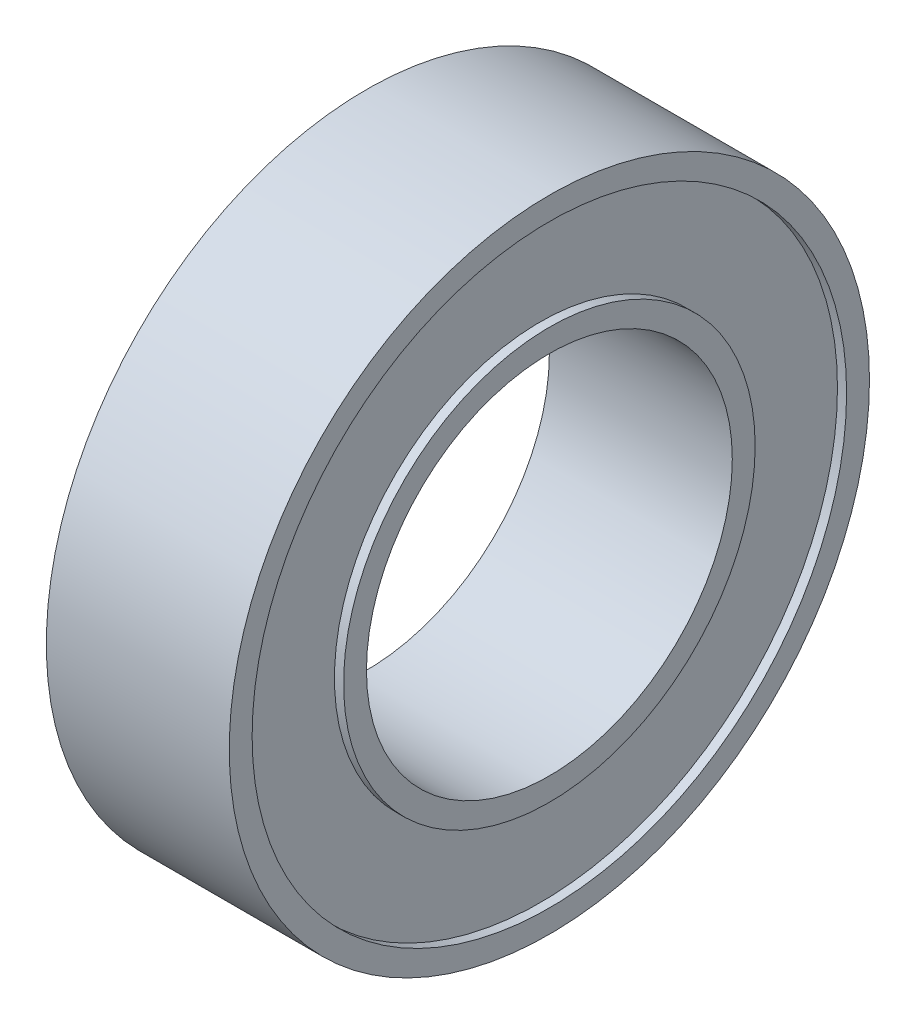
ISO-10303-21;
HEADER;
FILE_DESCRIPTION(('STEP AP214'),'2;1');
FILE_NAME('part.step','',(''),(''),'','','');
FILE_SCHEMA(('AUTOMOTIVE_DESIGN { 1 0 10303 214 1 1 1 1 }'));
ENDSEC;
DATA;
#1=APPLICATION_CONTEXT('core data for automotive mechanical design processes');
#2=APPLICATION_PROTOCOL_DEFINITION('international standard','automotive_design',2000,#1);
#3=PRODUCT_CONTEXT('',#1,'mechanical');
#4=PRODUCT('Part','Part','',(#3));
#5=PRODUCT_RELATED_PRODUCT_CATEGORY('part','',(#4));
#6=PRODUCT_DEFINITION_FORMATION('','',#4);
#7=PRODUCT_DEFINITION_CONTEXT('part definition',#1,'design');
#8=PRODUCT_DEFINITION('design','',#6,#7);
#9=PRODUCT_DEFINITION_SHAPE('','',#8);
#10=(LENGTH_UNIT() NAMED_UNIT(*) SI_UNIT(.MILLI.,.METRE.));
#11=(NAMED_UNIT(*) PLANE_ANGLE_UNIT() SI_UNIT($,.RADIAN.));
#12=(NAMED_UNIT(*) SI_UNIT($,.STERADIAN.) SOLID_ANGLE_UNIT());
#13=UNCERTAINTY_MEASURE_WITH_UNIT(LENGTH_MEASURE(1.E-05),#10,'distance_accuracy_value','');
#14=(GEOMETRIC_REPRESENTATION_CONTEXT(3) GLOBAL_UNCERTAINTY_ASSIGNED_CONTEXT((#13)) GLOBAL_UNIT_ASSIGNED_CONTEXT((#10,
#11,#12)) REPRESENTATION_CONTEXT('',''));
#15=CARTESIAN_POINT('',(0.,0.,0.));
#16=DIRECTION('',(0.,0.,1.));
#17=DIRECTION('',(1.,0.,0.));
#18=AXIS2_PLACEMENT_3D('',#15,#16,#17);
#19=CARTESIAN_POINT('',(0.,0.,0.));
#20=DIRECTION('',(1.,0.,0.));
#21=DIRECTION('',(0.,0.,-1.));
#22=AXIS2_PLACEMENT_3D('',#19,#20,#21);
#23=PLANE('',#22);
#24=CARTESIAN_POINT('',(0.,0.,0.));
#25=DIRECTION('',(1.,0.,0.));
#26=DIRECTION('',(0.,0.,-1.));
#27=AXIS2_PLACEMENT_3D('',#24,#25,#26);
#28=CIRCLE('',#27,4.);
#29=CARTESIAN_POINT('',(0.,0.,-4.));
#30=VERTEX_POINT('',#29);
#31=EDGE_CURVE('E46',#30,#30,#28,.T.);
#32=ORIENTED_EDGE('',*,*,#31,.T.);
#33=EDGE_LOOP('',(#32));
#34=FACE_BOUND('',#33,.T.);
#35=CARTESIAN_POINT('',(0.,0.,0.));
#36=DIRECTION('',(-1.,0.,0.));
#37=DIRECTION('',(0.,0.,1.));
#38=AXIS2_PLACEMENT_3D('',#35,#36,#37);
#39=CIRCLE('',#38,4.5);
#40=CARTESIAN_POINT('',(0.,0.,4.5));
#41=VERTEX_POINT('',#40);
#42=EDGE_CURVE('E70',#41,#41,#39,.T.);
#43=ORIENTED_EDGE('',*,*,#42,.T.);
#44=EDGE_LOOP('',(#43));
#45=FACE_BOUND('',#44,.T.);
#46=ADVANCED_FACE('F33',(#34,#45),#23,.F.);
#47=CARTESIAN_POINT('',(4.,0.,0.));
#48=DIRECTION('',(1.,0.,0.));
#49=DIRECTION('',(0.,0.,-1.));
#50=AXIS2_PLACEMENT_3D('',#47,#48,#49);
#51=PLANE('',#50);
#52=CARTESIAN_POINT('',(4.,0.,0.));
#53=DIRECTION('',(1.,0.,0.));
#54=DIRECTION('',(0.,0.,-1.));
#55=AXIS2_PLACEMENT_3D('',#52,#53,#54);
#56=CIRCLE('',#55,4.);
#57=CARTESIAN_POINT('',(4.,0.,-4.));
#58=VERTEX_POINT('',#57);
#59=EDGE_CURVE('E44',#58,#58,#56,.T.);
#60=ORIENTED_EDGE('',*,*,#59,.F.);
#61=EDGE_LOOP('',(#60));
#62=FACE_BOUND('',#61,.T.);
#63=CARTESIAN_POINT('',(4.,0.,0.));
#64=DIRECTION('',(1.,0.,0.));
#65=DIRECTION('',(0.,0.,-1.));
#66=AXIS2_PLACEMENT_3D('',#63,#64,#65);
#67=CIRCLE('',#66,4.5);
#68=CARTESIAN_POINT('',(4.,0.,-4.5));
#69=VERTEX_POINT('',#68);
#70=EDGE_CURVE('E58',#69,#69,#67,.T.);
#71=ORIENTED_EDGE('',*,*,#70,.T.);
#72=EDGE_LOOP('',(#71));
#73=FACE_BOUND('',#72,.T.);
#74=ADVANCED_FACE('F108',(#62,#73),#51,.T.);
#75=CARTESIAN_POINT('',(4.,0.,0.));
#76=DIRECTION('',(1.,0.,0.));
#77=DIRECTION('',(0.,0.,-1.));
#78=AXIS2_PLACEMENT_3D('',#75,#76,#77);
#79=CIRCLE('',#78,6.5);
#80=CARTESIAN_POINT('',(4.,0.,-6.5));
#81=VERTEX_POINT('',#80);
#82=EDGE_CURVE('E52',#81,#81,#79,.T.);
#83=ORIENTED_EDGE('',*,*,#82,.F.);
#84=EDGE_LOOP('',(#83));
#85=FACE_BOUND('',#84,.T.);
#86=CARTESIAN_POINT('',(4.,0.,0.));
#87=DIRECTION('',(1.,0.,0.));
#88=DIRECTION('',(0.,0.,-1.));
#89=AXIS2_PLACEMENT_3D('',#86,#87,#88);
#90=CIRCLE('',#89,7.);
#91=CARTESIAN_POINT('',(4.,0.,-7.));
#92=VERTEX_POINT('',#91);
#93=EDGE_CURVE('E10',#92,#92,#90,.T.);
#94=ORIENTED_EDGE('',*,*,#93,.T.);
#95=EDGE_LOOP('',(#94));
#96=FACE_BOUND('',#95,.T.);
#97=ADVANCED_FACE('F95',(#85,#96),#51,.T.);
#98=CARTESIAN_POINT('',(0.,0.,0.));
#99=DIRECTION('',(-1.,0.,0.));
#100=DIRECTION('',(0.,0.,1.));
#101=AXIS2_PLACEMENT_3D('',#98,#99,#100);
#102=CIRCLE('',#101,6.5);
#103=CARTESIAN_POINT('',(0.,0.,6.5));
#104=VERTEX_POINT('',#103);
#105=EDGE_CURVE('E64',#104,#104,#102,.T.);
#106=ORIENTED_EDGE('',*,*,#105,.F.);
#107=EDGE_LOOP('',(#106));
#108=FACE_BOUND('',#107,.T.);
#109=CARTESIAN_POINT('',(0.,0.,0.));
#110=DIRECTION('',(1.,0.,0.));
#111=DIRECTION('',(0.,0.,-1.));
#112=AXIS2_PLACEMENT_3D('',#109,#110,#111);
#113=CIRCLE('',#112,7.);
#114=CARTESIAN_POINT('',(0.,0.,-7.));
#115=VERTEX_POINT('',#114);
#116=EDGE_CURVE('E37',#115,#115,#113,.T.);
#117=ORIENTED_EDGE('',*,*,#116,.F.);
#118=EDGE_LOOP('',(#117));
#119=FACE_BOUND('',#118,.T.);
#120=ADVANCED_FACE('F92',(#108,#119),#23,.F.);
#121=CARTESIAN_POINT('',(4.,0.,0.));
#122=DIRECTION('',(-1.,0.,0.));
#123=DIRECTION('',(0.,0.,1.));
#124=AXIS2_PLACEMENT_3D('',#121,#122,#123);
#125=CYLINDRICAL_SURFACE('',#124,7.);
#126=ORIENTED_EDGE('',*,*,#93,.F.);
#127=EDGE_LOOP('',(#126));
#128=FACE_BOUND('',#127,.T.);
#129=ORIENTED_EDGE('',*,*,#116,.T.);
#130=EDGE_LOOP('',(#129));
#131=FACE_BOUND('',#130,.T.);
#132=ADVANCED_FACE('F35',(#128,#131),#125,.T.);
#133=CARTESIAN_POINT('',(4.,0.,0.));
#134=DIRECTION('',(-1.,0.,0.));
#135=DIRECTION('',(0.,0.,1.));
#136=AXIS2_PLACEMENT_3D('',#133,#134,#135);
#137=CYLINDRICAL_SURFACE('',#136,4.);
#138=ORIENTED_EDGE('',*,*,#59,.T.);
#139=EDGE_LOOP('',(#138));
#140=FACE_BOUND('',#139,.T.);
#141=ORIENTED_EDGE('',*,*,#31,.F.);
#142=EDGE_LOOP('',(#141));
#143=FACE_BOUND('',#142,.T.);
#144=ADVANCED_FACE('F99',(#140,#143),#137,.F.);
#145=CARTESIAN_POINT('',(3.8,0.,0.));
#146=DIRECTION('',(1.,0.,0.));
#147=DIRECTION('',(0.,0.,-1.));
#148=AXIS2_PLACEMENT_3D('',#145,#146,#147);
#149=CYLINDRICAL_SURFACE('',#148,6.5);
#150=CARTESIAN_POINT('',(3.8,0.,0.));
#151=DIRECTION('',(1.,0.,0.));
#152=DIRECTION('',(0.,0.,-1.));
#153=AXIS2_PLACEMENT_3D('',#150,#151,#152);
#154=CIRCLE('',#153,6.5);
#155=CARTESIAN_POINT('',(3.8,0.,-6.5));
#156=VERTEX_POINT('',#155);
#157=EDGE_CURVE('E49',#156,#156,#154,.T.);
#158=ORIENTED_EDGE('',*,*,#157,.F.);
#159=EDGE_LOOP('',(#158));
#160=FACE_BOUND('',#159,.T.);
#161=ORIENTED_EDGE('',*,*,#82,.T.);
#162=EDGE_LOOP('',(#161));
#163=FACE_BOUND('',#162,.T.);
#164=ADVANCED_FACE('F104',(#160,#163),#149,.F.);
#165=CARTESIAN_POINT('',(3.8,0.,0.));
#166=DIRECTION('',(1.,0.,0.));
#167=DIRECTION('',(0.,0.,-1.));
#168=AXIS2_PLACEMENT_3D('',#165,#166,#167);
#169=PLANE('',#168);
#170=CARTESIAN_POINT('',(3.8,0.,0.));
#171=DIRECTION('',(1.,0.,0.));
#172=DIRECTION('',(0.,0.,-1.));
#173=AXIS2_PLACEMENT_3D('',#170,#171,#172);
#174=CIRCLE('',#173,4.5);
#175=CARTESIAN_POINT('',(3.8,0.,-4.5));
#176=VERTEX_POINT('',#175);
#177=EDGE_CURVE('E55',#176,#176,#174,.T.);
#178=ORIENTED_EDGE('',*,*,#177,.F.);
#179=EDGE_LOOP('',(#178));
#180=FACE_BOUND('',#179,.T.);
#181=ORIENTED_EDGE('',*,*,#157,.T.);
#182=EDGE_LOOP('',(#181));
#183=FACE_BOUND('',#182,.T.);
#184=ADVANCED_FACE('F121',(#180,#183),#169,.T.);
#185=CARTESIAN_POINT('',(3.8,0.,0.));
#186=DIRECTION('',(1.,0.,0.));
#187=DIRECTION('',(0.,0.,-1.));
#188=AXIS2_PLACEMENT_3D('',#185,#186,#187);
#189=CYLINDRICAL_SURFACE('',#188,4.5);
#190=ORIENTED_EDGE('',*,*,#177,.T.);
#191=EDGE_LOOP('',(#190));
#192=FACE_BOUND('',#191,.T.);
#193=ORIENTED_EDGE('',*,*,#70,.F.);
#194=EDGE_LOOP('',(#193));
#195=FACE_BOUND('',#194,.T.);
#196=ADVANCED_FACE('F88',(#192,#195),#189,.T.);
#197=CARTESIAN_POINT('',(0.2,0.,0.));
#198=DIRECTION('',(-1.,0.,0.));
#199=DIRECTION('',(0.,0.,1.));
#200=AXIS2_PLACEMENT_3D('',#197,#198,#199);
#201=CYLINDRICAL_SURFACE('',#200,6.5);
#202=CARTESIAN_POINT('',(0.2,0.,0.));
#203=DIRECTION('',(-1.,0.,0.));
#204=DIRECTION('',(0.,0.,1.));
#205=AXIS2_PLACEMENT_3D('',#202,#203,#204);
#206=CIRCLE('',#205,6.5);
#207=CARTESIAN_POINT('',(0.2,0.,6.5));
#208=VERTEX_POINT('',#207);
#209=EDGE_CURVE('E61',#208,#208,#206,.T.);
#210=ORIENTED_EDGE('',*,*,#209,.F.);
#211=EDGE_LOOP('',(#210));
#212=FACE_BOUND('',#211,.T.);
#213=ORIENTED_EDGE('',*,*,#105,.T.);
#214=EDGE_LOOP('',(#213));
#215=FACE_BOUND('',#214,.T.);
#216=ADVANCED_FACE('F82',(#212,#215),#201,.F.);
#217=CARTESIAN_POINT('',(0.2,0.,0.));
#218=DIRECTION('',(-1.,0.,0.));
#219=DIRECTION('',(0.,0.,1.));
#220=AXIS2_PLACEMENT_3D('',#217,#218,#219);
#221=PLANE('',#220);
#222=CARTESIAN_POINT('',(0.2,0.,0.));
#223=DIRECTION('',(-1.,0.,0.));
#224=DIRECTION('',(0.,0.,1.));
#225=AXIS2_PLACEMENT_3D('',#222,#223,#224);
#226=CIRCLE('',#225,4.5);
#227=CARTESIAN_POINT('',(0.2,0.,4.5));
#228=VERTEX_POINT('',#227);
#229=EDGE_CURVE('E67',#228,#228,#226,.T.);
#230=ORIENTED_EDGE('',*,*,#229,.F.);
#231=EDGE_LOOP('',(#230));
#232=FACE_BOUND('',#231,.T.);
#233=ORIENTED_EDGE('',*,*,#209,.T.);
#234=EDGE_LOOP('',(#233));
#235=FACE_BOUND('',#234,.T.);
#236=ADVANCED_FACE('F79',(#232,#235),#221,.T.);
#237=CARTESIAN_POINT('',(0.2,0.,0.));
#238=DIRECTION('',(-1.,0.,0.));
#239=DIRECTION('',(0.,0.,1.));
#240=AXIS2_PLACEMENT_3D('',#237,#238,#239);
#241=CYLINDRICAL_SURFACE('',#240,4.5);
#242=ORIENTED_EDGE('',*,*,#229,.T.);
#243=EDGE_LOOP('',(#242));
#244=FACE_BOUND('',#243,.T.);
#245=ORIENTED_EDGE('',*,*,#42,.F.);
#246=EDGE_LOOP('',(#245));
#247=FACE_BOUND('',#246,.T.);
#248=ADVANCED_FACE('F76',(#244,#247),#241,.T.);
#249=CLOSED_SHELL('',(#46,#74,#97,#120,#132,#144,#164,#184,#196,#216,#236,#248));
#250=MANIFOLD_SOLID_BREP('B2',#249);
#251=ADVANCED_BREP_SHAPE_REPRESENTATION('',(#18,#250),#14);
#252=SHAPE_DEFINITION_REPRESENTATION(#9,#251);
ENDSEC;
END-ISO-10303-21;
